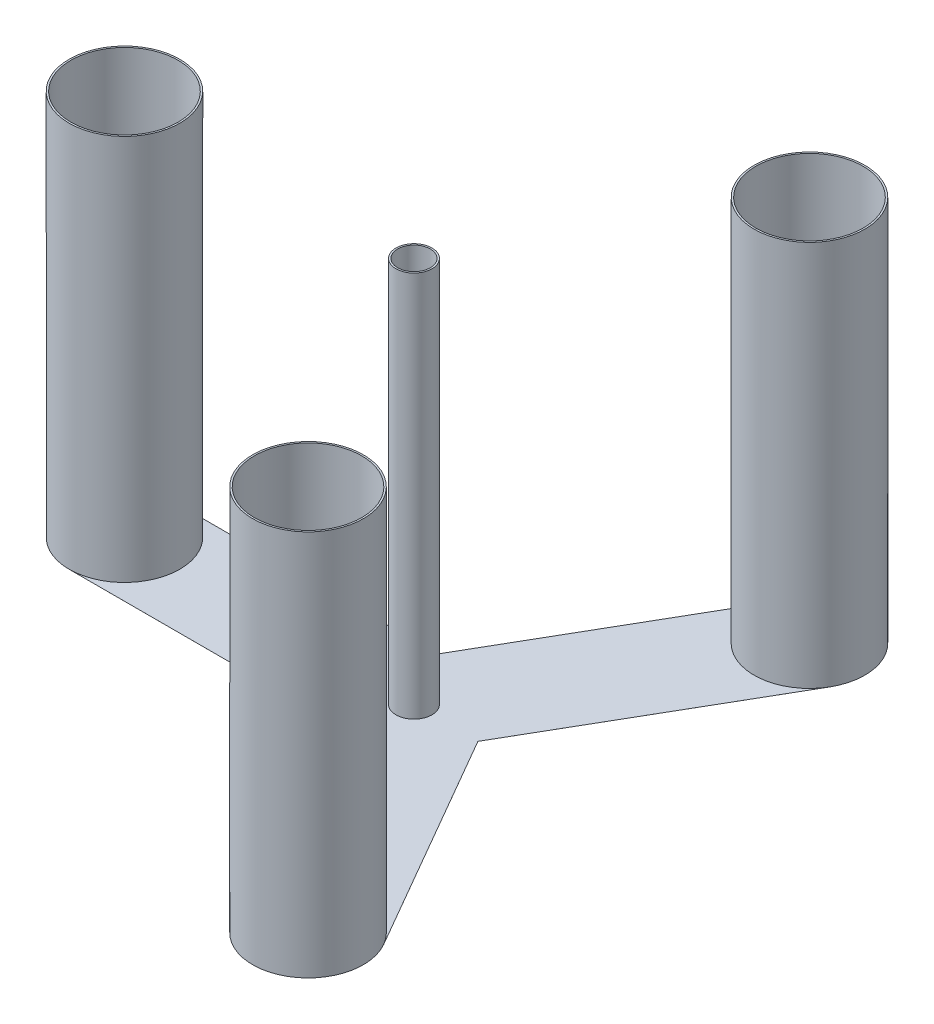
ISO-10303-21;
HEADER;
FILE_DESCRIPTION(('STEP AP214'),'2;1');
FILE_NAME('part.step','',(''),(''),'','','');
FILE_SCHEMA(('AUTOMOTIVE_DESIGN { 1 0 10303 214 1 1 1 1 }'));
ENDSEC;
DATA;
#1=APPLICATION_CONTEXT('core data for automotive mechanical design processes');
#2=APPLICATION_PROTOCOL_DEFINITION('international standard','automotive_design',2000,#1);
#3=PRODUCT_CONTEXT('',#1,'mechanical');
#4=PRODUCT('Part','Part','',(#3));
#5=PRODUCT_RELATED_PRODUCT_CATEGORY('part','',(#4));
#6=PRODUCT_DEFINITION_FORMATION('','',#4);
#7=PRODUCT_DEFINITION_CONTEXT('part definition',#1,'design');
#8=PRODUCT_DEFINITION('design','',#6,#7);
#9=PRODUCT_DEFINITION_SHAPE('','',#8);
#10=(LENGTH_UNIT() NAMED_UNIT(*) SI_UNIT(.MILLI.,.METRE.));
#11=(NAMED_UNIT(*) PLANE_ANGLE_UNIT() SI_UNIT($,.RADIAN.));
#12=(NAMED_UNIT(*) SI_UNIT($,.STERADIAN.) SOLID_ANGLE_UNIT());
#13=UNCERTAINTY_MEASURE_WITH_UNIT(LENGTH_MEASURE(1.E-05),#10,'distance_accuracy_value','');
#14=(GEOMETRIC_REPRESENTATION_CONTEXT(3) GLOBAL_UNCERTAINTY_ASSIGNED_CONTEXT((#13)) GLOBAL_UNIT_ASSIGNED_CONTEXT((#10,
#11,#12)) REPRESENTATION_CONTEXT('',''));
#15=CARTESIAN_POINT('',(0.,0.,0.));
#16=DIRECTION('',(0.,0.,1.));
#17=DIRECTION('',(1.,0.,0.));
#18=AXIS2_PLACEMENT_3D('',#15,#16,#17);
#19=CARTESIAN_POINT('',(-37.2390923627285,0.01,-64.5));
#20=DIRECTION('',(0.866025403784436,0.,0.500000000000004));
#21=DIRECTION('',(0.500000000000004,0.,-0.866025403784436));
#22=AXIS2_PLACEMENT_3D('',#19,#20,#21);
#23=PLANE('',#22);
#24=DIRECTION('',(-0.500000000000004,0.,0.866025403784436));
#25=VECTOR('',#24,1.);
#26=CARTESIAN_POINT('',(-37.2390923627285,0.,-64.5));
#27=LINE('',#26,#25);
#28=CARTESIAN_POINT('',(112.760907637273,0.,-324.307621135331));
#29=VERTEX_POINT('',#28);
#30=CARTESIAN_POINT('',(-37.2390923627285,0.,-64.5));
#31=VERTEX_POINT('',#30);
#32=EDGE_CURVE('E157',#29,#31,#27,.T.);
#33=ORIENTED_EDGE('',*,*,#32,.T.);
#34=DIRECTION('',(0.,-1.,0.));
#35=VECTOR('',#34,1.);
#36=CARTESIAN_POINT('',(-37.2390923627285,0.01,-64.5));
#37=LINE('',#36,#35);
#38=CARTESIAN_POINT('',(-37.2390923627285,0.01,-64.5));
#39=VERTEX_POINT('',#38);
#40=EDGE_CURVE('E205',#39,#31,#37,.T.);
#41=ORIENTED_EDGE('',*,*,#40,.F.);
#42=DIRECTION('',(-0.500000000000004,0.,0.866025403784436));
#43=VECTOR('',#42,1.);
#44=CARTESIAN_POINT('',(-37.2390923627285,0.01,-64.5));
#45=LINE('',#44,#43);
#46=CARTESIAN_POINT('',(112.760907637273,0.01,-324.307621135331));
#47=VERTEX_POINT('',#46);
#48=EDGE_CURVE('E183',#47,#39,#45,.T.);
#49=ORIENTED_EDGE('',*,*,#48,.F.);
#50=DIRECTION('',(0.,-1.,0.));
#51=VECTOR('',#50,1.);
#52=CARTESIAN_POINT('',(112.760907637273,0.01,-324.307621135331));
#53=LINE('',#52,#51);
#54=EDGE_CURVE('E151',#47,#29,#53,.T.);
#55=ORIENTED_EDGE('',*,*,#54,.T.);
#56=EDGE_LOOP('',(#33,#41,#49,#55));
#57=FACE_BOUND('',#56,.T.);
#58=ADVANCED_FACE('F41',(#57),#23,.F.);
#59=CARTESIAN_POINT('',(-37.2390923627285,0.01,-64.5));
#60=DIRECTION('',(0.,0.,1.));
#61=DIRECTION('',(1.,0.,0.));
#62=AXIS2_PLACEMENT_3D('',#59,#60,#61);
#63=PLANE('',#62);
#64=DIRECTION('',(-1.,0.,0.));
#65=VECTOR('',#64,1.);
#66=CARTESIAN_POINT('',(-37.2390923627285,0.,-64.5));
#67=LINE('',#66,#65);
#68=CARTESIAN_POINT('',(-337.239092362728,0.,-64.5));
#69=VERTEX_POINT('',#68);
#70=EDGE_CURVE('E161',#31,#69,#67,.T.);
#71=ORIENTED_EDGE('',*,*,#70,.T.);
#72=DIRECTION('',(0.,-1.,0.));
#73=VECTOR('',#72,1.);
#74=CARTESIAN_POINT('',(-337.239092362728,0.01,-64.5));
#75=LINE('',#74,#73);
#76=CARTESIAN_POINT('',(-337.239092362728,0.01,-64.5));
#77=VERTEX_POINT('',#76);
#78=EDGE_CURVE('E201',#77,#69,#75,.T.);
#79=ORIENTED_EDGE('',*,*,#78,.F.);
#80=DIRECTION('',(-1.,0.,0.));
#81=VECTOR('',#80,1.);
#82=CARTESIAN_POINT('',(-37.2390923627285,0.01,-64.5));
#83=LINE('',#82,#81);
#84=EDGE_CURVE('E106',#39,#77,#83,.T.);
#85=ORIENTED_EDGE('',*,*,#84,.F.);
#86=ORIENTED_EDGE('',*,*,#40,.T.);
#87=EDGE_LOOP('',(#71,#79,#85,#86));
#88=FACE_BOUND('',#87,.T.);
#89=ADVANCED_FACE('F238',(#88),#63,.F.);
#90=CARTESIAN_POINT('',(-337.239092362728,0.01,0.));
#91=DIRECTION('',(0.,-1.,0.));
#92=DIRECTION('',(0.,0.,-1.));
#93=AXIS2_PLACEMENT_3D('',#90,#91,#92);
#94=CYLINDRICAL_SURFACE('',#93,64.5);
#95=CARTESIAN_POINT('',(-337.239092362728,0.,0.));
#96=DIRECTION('',(0.,1.,0.));
#97=DIRECTION('',(0.,0.,-1.));
#98=AXIS2_PLACEMENT_3D('',#95,#96,#97);
#99=CIRCLE('',#98,64.5);
#100=CARTESIAN_POINT('',(-337.239092362728,0.,64.5));
#101=VERTEX_POINT('',#100);
#102=EDGE_CURVE('E165',#69,#101,#99,.T.);
#103=ORIENTED_EDGE('',*,*,#102,.T.);
#104=DIRECTION('',(0.,-1.,0.));
#105=VECTOR('',#104,1.);
#106=CARTESIAN_POINT('',(-337.239092362728,0.01,64.5));
#107=LINE('',#106,#105);
#108=CARTESIAN_POINT('',(-337.239092362728,0.01,64.5));
#109=VERTEX_POINT('',#108);
#110=EDGE_CURVE('E197',#109,#101,#107,.T.);
#111=ORIENTED_EDGE('',*,*,#110,.F.);
#112=CARTESIAN_POINT('',(-337.239092362728,0.01,0.));
#113=DIRECTION('',(0.,1.,0.));
#114=DIRECTION('',(0.,0.,1.));
#115=AXIS2_PLACEMENT_3D('',#112,#113,#114);
#116=CIRCLE('',#115,64.5);
#117=EDGE_CURVE('E254',#109,#77,#116,.T.);
#118=ORIENTED_EDGE('',*,*,#117,.T.);
#119=ORIENTED_EDGE('',*,*,#78,.T.);
#120=EDGE_LOOP('',(#103,#111,#118,#119));
#121=FACE_BOUND('',#120,.T.);
#122=CARTESIAN_POINT('',(-337.239092362728,450.01,0.));
#123=DIRECTION('',(0.,1.,0.));
#124=DIRECTION('',(0.,0.,1.));
#125=AXIS2_PLACEMENT_3D('',#122,#123,#124);
#126=CIRCLE('',#125,64.5);
#127=CARTESIAN_POINT('',(-337.239092362728,450.01,64.5));
#128=VERTEX_POINT('',#127);
#129=EDGE_CURVE('E257',#128,#128,#126,.T.);
#130=ORIENTED_EDGE('',*,*,#129,.F.);
#131=EDGE_LOOP('',(#130));
#132=FACE_BOUND('',#131,.T.);
#133=ADVANCED_FACE('F243',(#121,#132),#94,.T.);
#134=CARTESIAN_POINT('',(-337.239092362728,0.01,64.5));
#135=DIRECTION('',(0.,0.,-1.));
#136=DIRECTION('',(-1.,0.,0.));
#137=AXIS2_PLACEMENT_3D('',#134,#135,#136);
#138=PLANE('',#137);
#139=DIRECTION('',(1.,0.,0.));
#140=VECTOR('',#139,1.);
#141=CARTESIAN_POINT('',(-337.239092362728,0.,64.5));
#142=LINE('',#141,#140);
#143=CARTESIAN_POINT('',(-37.2390923627348,0.,64.5));
#144=VERTEX_POINT('',#143);
#145=EDGE_CURVE('E168',#101,#144,#142,.T.);
#146=ORIENTED_EDGE('',*,*,#145,.T.);
#147=DIRECTION('',(0.,-1.,0.));
#148=VECTOR('',#147,1.);
#149=CARTESIAN_POINT('',(-37.2390923627348,0.01,64.5));
#150=LINE('',#149,#148);
#151=CARTESIAN_POINT('',(-37.2390923627348,0.01,64.5));
#152=VERTEX_POINT('',#151);
#153=EDGE_CURVE('E193',#152,#144,#150,.T.);
#154=ORIENTED_EDGE('',*,*,#153,.F.);
#155=DIRECTION('',(1.,0.,0.));
#156=VECTOR('',#155,1.);
#157=CARTESIAN_POINT('',(-337.239092362728,0.01,64.5));
#158=LINE('',#157,#156);
#159=EDGE_CURVE('E153',#109,#152,#158,.T.);
#160=ORIENTED_EDGE('',*,*,#159,.F.);
#161=ORIENTED_EDGE('',*,*,#110,.T.);
#162=EDGE_LOOP('',(#146,#154,#160,#161));
#163=FACE_BOUND('',#162,.T.);
#164=ADVANCED_FACE('F298',(#163),#138,.F.);
#165=CARTESIAN_POINT('',(112.760907637267,0.01,324.307621135331));
#166=DIRECTION('',(0.866025403784436,0.,-0.500000000000004));
#167=DIRECTION('',(-0.500000000000004,0.,-0.866025403784436));
#168=AXIS2_PLACEMENT_3D('',#165,#166,#167);
#169=PLANE('',#168);
#170=DIRECTION('',(0.500000000000004,0.,0.866025403784436));
#171=VECTOR('',#170,1.);
#172=CARTESIAN_POINT('',(112.760907637267,0.,324.307621135331));
#173=LINE('',#172,#171);
#174=CARTESIAN_POINT('',(112.760907637267,0.,324.307621135331));
#175=VERTEX_POINT('',#174);
#176=EDGE_CURVE('E171',#144,#175,#173,.T.);
#177=ORIENTED_EDGE('',*,*,#176,.T.);
#178=DIRECTION('',(0.,-1.,0.));
#179=VECTOR('',#178,1.);
#180=CARTESIAN_POINT('',(112.760907637267,0.01,324.307621135331));
#181=LINE('',#180,#179);
#182=CARTESIAN_POINT('',(112.760907637267,0.01,324.307621135331));
#183=VERTEX_POINT('',#182);
#184=EDGE_CURVE('E143',#183,#175,#181,.T.);
#185=ORIENTED_EDGE('',*,*,#184,.F.);
#186=DIRECTION('',(0.500000000000004,0.,0.866025403784436));
#187=VECTOR('',#186,1.);
#188=CARTESIAN_POINT('',(112.760907637267,0.01,324.307621135331));
#189=LINE('',#188,#187);
#190=EDGE_CURVE('E127',#152,#183,#189,.T.);
#191=ORIENTED_EDGE('',*,*,#190,.F.);
#192=ORIENTED_EDGE('',*,*,#153,.T.);
#193=EDGE_LOOP('',(#177,#185,#191,#192));
#194=FACE_BOUND('',#193,.T.);
#195=ADVANCED_FACE('F302',(#194),#169,.F.);
#196=CARTESIAN_POINT('',(168.619546181364,0.01,292.057621135332));
#197=DIRECTION('',(0.,-1.,0.));
#198=DIRECTION('',(0.,0.,-1.));
#199=AXIS2_PLACEMENT_3D('',#196,#197,#198);
#200=CYLINDRICAL_SURFACE('',#199,64.5);
#201=CARTESIAN_POINT('',(168.619546181364,0.,292.057621135332));
#202=DIRECTION('',(0.,1.,0.));
#203=DIRECTION('',(0.,0.,-1.));
#204=AXIS2_PLACEMENT_3D('',#201,#202,#203);
#205=CIRCLE('',#204,64.5);
#206=CARTESIAN_POINT('',(224.47818472546,0.,259.807621135333));
#207=VERTEX_POINT('',#206);
#208=EDGE_CURVE('E139',#175,#207,#205,.T.);
#209=ORIENTED_EDGE('',*,*,#208,.T.);
#210=DIRECTION('',(0.,-1.,0.));
#211=VECTOR('',#210,1.);
#212=CARTESIAN_POINT('',(224.47818472546,0.01,259.807621135333));
#213=LINE('',#212,#211);
#214=CARTESIAN_POINT('',(224.47818472546,0.01,259.807621135333));
#215=VERTEX_POINT('',#214);
#216=EDGE_CURVE('E135',#215,#207,#213,.T.);
#217=ORIENTED_EDGE('',*,*,#216,.F.);
#218=CARTESIAN_POINT('',(168.619546181364,0.01,292.057621135332));
#219=DIRECTION('',(0.,1.,0.));
#220=DIRECTION('',(0.,0.,1.));
#221=AXIS2_PLACEMENT_3D('',#218,#219,#220);
#222=CIRCLE('',#221,64.5);
#223=EDGE_CURVE('E118',#215,#183,#222,.T.);
#224=ORIENTED_EDGE('',*,*,#223,.T.);
#225=ORIENTED_EDGE('',*,*,#184,.T.);
#226=EDGE_LOOP('',(#209,#217,#224,#225));
#227=FACE_BOUND('',#226,.T.);
#228=CARTESIAN_POINT('',(168.619546181364,450.01,292.057621135332));
#229=DIRECTION('',(0.,1.,0.));
#230=DIRECTION('',(0.,0.,1.));
#231=AXIS2_PLACEMENT_3D('',#228,#229,#230);
#232=CIRCLE('',#231,64.5);
#233=CARTESIAN_POINT('',(168.619546181364,450.01,356.557621135332));
#234=VERTEX_POINT('',#233);
#235=EDGE_CURVE('E131',#234,#234,#232,.T.);
#236=ORIENTED_EDGE('',*,*,#235,.F.);
#237=EDGE_LOOP('',(#236));
#238=FACE_BOUND('',#237,.T.);
#239=ADVANCED_FACE('F136',(#227,#238),#200,.T.);
#240=CARTESIAN_POINT('',(74.4781847254622,0.01,0.));
#241=DIRECTION('',(-0.866025403784442,0.,0.499999999999994));
#242=DIRECTION('',(0.499999999999994,0.,0.866025403784442));
#243=AXIS2_PLACEMENT_3D('',#240,#241,#242);
#244=PLANE('',#243);
#245=DIRECTION('',(-0.499999999999994,0.,-0.866025403784442));
#246=VECTOR('',#245,1.);
#247=CARTESIAN_POINT('',(74.4781847254622,0.,0.));
#248=LINE('',#247,#246);
#249=CARTESIAN_POINT('',(74.4781847254622,0.,0.));
#250=VERTEX_POINT('',#249);
#251=EDGE_CURVE('E176',#207,#250,#248,.T.);
#252=ORIENTED_EDGE('',*,*,#251,.T.);
#253=DIRECTION('',(0.,-1.,0.));
#254=VECTOR('',#253,1.);
#255=CARTESIAN_POINT('',(74.4781847254622,0.01,0.));
#256=LINE('',#255,#254);
#257=CARTESIAN_POINT('',(74.4781847254622,0.01,0.));
#258=VERTEX_POINT('',#257);
#259=EDGE_CURVE('E144',#258,#250,#256,.T.);
#260=ORIENTED_EDGE('',*,*,#259,.F.);
#261=DIRECTION('',(-0.499999999999994,0.,-0.866025403784442));
#262=VECTOR('',#261,1.);
#263=CARTESIAN_POINT('',(74.4781847254622,0.01,0.));
#264=LINE('',#263,#262);
#265=EDGE_CURVE('E123',#215,#258,#264,.T.);
#266=ORIENTED_EDGE('',*,*,#265,.F.);
#267=ORIENTED_EDGE('',*,*,#216,.T.);
#268=EDGE_LOOP('',(#252,#260,#266,#267));
#269=FACE_BOUND('',#268,.T.);
#270=ADVANCED_FACE('F146',(#269),#244,.F.);
#271=CARTESIAN_POINT('',(224.478184725465,0.01,-259.80762113533));
#272=DIRECTION('',(-0.866025403784433,0.,-0.500000000000009));
#273=DIRECTION('',(-0.500000000000009,0.,0.866025403784434));
#274=AXIS2_PLACEMENT_3D('',#271,#272,#273);
#275=PLANE('',#274);
#276=DIRECTION('',(0.500000000000009,0.,-0.866025403784434));
#277=VECTOR('',#276,1.);
#278=CARTESIAN_POINT('',(224.478184725465,0.,-259.80762113533));
#279=LINE('',#278,#277);
#280=CARTESIAN_POINT('',(224.478184725465,0.,-259.80762113533));
#281=VERTEX_POINT('',#280);
#282=EDGE_CURVE('E90',#250,#281,#279,.T.);
#283=ORIENTED_EDGE('',*,*,#282,.T.);
#284=DIRECTION('',(0.,-1.,0.));
#285=VECTOR('',#284,1.);
#286=CARTESIAN_POINT('',(224.478184725465,0.01,-259.80762113533));
#287=LINE('',#286,#285);
#288=CARTESIAN_POINT('',(224.478184725465,0.01,-259.80762113533));
#289=VERTEX_POINT('',#288);
#290=EDGE_CURVE('E186',#289,#281,#287,.T.);
#291=ORIENTED_EDGE('',*,*,#290,.F.);
#292=DIRECTION('',(0.500000000000009,0.,-0.866025403784434));
#293=VECTOR('',#292,1.);
#294=CARTESIAN_POINT('',(224.478184725465,0.01,-259.80762113533));
#295=LINE('',#294,#293);
#296=EDGE_CURVE('E58',#258,#289,#295,.T.);
#297=ORIENTED_EDGE('',*,*,#296,.F.);
#298=ORIENTED_EDGE('',*,*,#259,.T.);
#299=EDGE_LOOP('',(#283,#291,#297,#298));
#300=FACE_BOUND('',#299,.T.);
#301=ADVANCED_FACE('F225',(#300),#275,.F.);
#302=CARTESIAN_POINT('',(168.619546181369,0.01,-292.057621135331));
#303=DIRECTION('',(0.,-1.,0.));
#304=DIRECTION('',(0.,0.,-1.));
#305=AXIS2_PLACEMENT_3D('',#302,#303,#304);
#306=CYLINDRICAL_SURFACE('',#305,64.5);
#307=CARTESIAN_POINT('',(168.619546181369,0.,-292.057621135331));
#308=DIRECTION('',(0.,1.,0.));
#309=DIRECTION('',(0.,0.,-1.));
#310=AXIS2_PLACEMENT_3D('',#307,#308,#309);
#311=CIRCLE('',#310,64.5);
#312=EDGE_CURVE('E97',#281,#29,#311,.T.);
#313=ORIENTED_EDGE('',*,*,#312,.T.);
#314=ORIENTED_EDGE('',*,*,#54,.F.);
#315=CARTESIAN_POINT('',(168.619546181369,0.01000000000001,-292.057621135331));
#316=DIRECTION('',(0.,-1.,0.));
#317=DIRECTION('',(0.,0.,-1.));
#318=AXIS2_PLACEMENT_3D('',#315,#316,#317);
#319=CIRCLE('',#318,64.5);
#320=EDGE_CURVE('E11',#47,#289,#319,.F.);
#321=ORIENTED_EDGE('',*,*,#320,.T.);
#322=ORIENTED_EDGE('',*,*,#290,.T.);
#323=EDGE_LOOP('',(#313,#314,#321,#322));
#324=FACE_BOUND('',#323,.T.);
#325=CARTESIAN_POINT('',(168.619546181369,450.01,-292.057621135331));
#326=DIRECTION('',(0.,1.,0.));
#327=DIRECTION('',(0.,0.,1.));
#328=AXIS2_PLACEMENT_3D('',#325,#326,#327);
#329=CIRCLE('',#328,64.5);
#330=CARTESIAN_POINT('',(168.619546181369,450.01,-227.557621135331));
#331=VERTEX_POINT('',#330);
#332=EDGE_CURVE('E274',#331,#331,#329,.T.);
#333=ORIENTED_EDGE('',*,*,#332,.F.);
#334=EDGE_LOOP('',(#333));
#335=FACE_BOUND('',#334,.T.);
#336=ADVANCED_FACE('F214',(#324,#335),#306,.T.);
#337=CARTESIAN_POINT('',(168.619546181369,0.01,-292.057621135331));
#338=DIRECTION('',(0.,-1.,0.));
#339=DIRECTION('',(0.,0.,-1.));
#340=AXIS2_PLACEMENT_3D('',#337,#338,#339);
#341=PLANE('',#340);
#342=ORIENTED_EDGE('',*,*,#223,.F.);
#343=ORIENTED_EDGE('',*,*,#265,.T.);
#344=ORIENTED_EDGE('',*,*,#296,.T.);
#345=ORIENTED_EDGE('',*,*,#320,.F.);
#346=ORIENTED_EDGE('',*,*,#48,.T.);
#347=ORIENTED_EDGE('',*,*,#84,.T.);
#348=ORIENTED_EDGE('',*,*,#117,.F.);
#349=ORIENTED_EDGE('',*,*,#159,.T.);
#350=ORIENTED_EDGE('',*,*,#190,.T.);
#351=EDGE_LOOP('',(#342,#343,#344,#345,#346,#347,#348,#349,#350));
#352=FACE_BOUND('',#351,.T.);
#353=CARTESIAN_POINT('',(0.,0.01000000000001,0.));
#354=DIRECTION('',(0.,-1.,0.));
#355=DIRECTION('',(0.,0.,-1.));
#356=AXIS2_PLACEMENT_3D('',#353,#354,#355);
#357=CIRCLE('',#356,21.);
#358=CARTESIAN_POINT('',(0.,0.01000000000001,-21.));
#359=VERTEX_POINT('',#358);
#360=EDGE_CURVE('E50',#359,#359,#357,.F.);
#361=ORIENTED_EDGE('',*,*,#360,.F.);
#362=EDGE_LOOP('',(#361));
#363=FACE_BOUND('',#362,.T.);
#364=ADVANCED_FACE('F120',(#352,#363),#341,.F.);
#365=CARTESIAN_POINT('',(168.619546181369,0.,-292.057621135331));
#366=DIRECTION('',(0.,-1.,0.));
#367=DIRECTION('',(0.,0.,-1.));
#368=AXIS2_PLACEMENT_3D('',#365,#366,#367);
#369=PLANE('',#368);
#370=ORIENTED_EDGE('',*,*,#32,.F.);
#371=ORIENTED_EDGE('',*,*,#312,.F.);
#372=ORIENTED_EDGE('',*,*,#282,.F.);
#373=ORIENTED_EDGE('',*,*,#251,.F.);
#374=ORIENTED_EDGE('',*,*,#208,.F.);
#375=ORIENTED_EDGE('',*,*,#176,.F.);
#376=ORIENTED_EDGE('',*,*,#145,.F.);
#377=ORIENTED_EDGE('',*,*,#102,.F.);
#378=ORIENTED_EDGE('',*,*,#70,.F.);
#379=EDGE_LOOP('',(#370,#371,#372,#373,#374,#375,#376,#377,#378));
#380=FACE_BOUND('',#379,.T.);
#381=ADVANCED_FACE('F213',(#380),#369,.T.);
#382=CARTESIAN_POINT('',(0.,450.01,0.));
#383=DIRECTION('',(0.,1.,0.));
#384=DIRECTION('',(0.,0.,1.));
#385=AXIS2_PLACEMENT_3D('',#382,#383,#384);
#386=PLANE('',#385);
#387=CARTESIAN_POINT('',(0.,450.01,0.));
#388=DIRECTION('',(0.,1.,0.));
#389=DIRECTION('',(0.,0.,1.));
#390=AXIS2_PLACEMENT_3D('',#387,#388,#389);
#391=CIRCLE('',#390,21.);
#392=CARTESIAN_POINT('',(0.,450.01,21.));
#393=VERTEX_POINT('',#392);
#394=EDGE_CURVE('E162',#393,#393,#391,.T.);
#395=ORIENTED_EDGE('',*,*,#394,.T.);
#396=EDGE_LOOP('',(#395));
#397=FACE_BOUND('',#396,.T.);
#398=CARTESIAN_POINT('',(0.,450.01,0.));
#399=DIRECTION('',(0.,1.,0.));
#400=DIRECTION('',(0.,0.,1.));
#401=AXIS2_PLACEMENT_3D('',#398,#399,#400);
#402=CIRCLE('',#401,19.);
#403=CARTESIAN_POINT('',(0.,450.01,19.));
#404=VERTEX_POINT('',#403);
#405=EDGE_CURVE('E282',#404,#404,#402,.T.);
#406=ORIENTED_EDGE('',*,*,#405,.F.);
#407=EDGE_LOOP('',(#406));
#408=FACE_BOUND('',#407,.T.);
#409=ADVANCED_FACE('F222',(#397,#408),#386,.T.);
#410=CARTESIAN_POINT('',(0.,450.01,0.));
#411=DIRECTION('',(0.,-1.,0.));
#412=DIRECTION('',(0.,0.,-1.));
#413=AXIS2_PLACEMENT_3D('',#410,#411,#412);
#414=CYLINDRICAL_SURFACE('',#413,21.);
#415=ORIENTED_EDGE('',*,*,#394,.F.);
#416=EDGE_LOOP('',(#415));
#417=FACE_BOUND('',#416,.T.);
#418=ORIENTED_EDGE('',*,*,#360,.T.);
#419=EDGE_LOOP('',(#418));
#420=FACE_BOUND('',#419,.T.);
#421=ADVANCED_FACE('F211',(#417,#420),#414,.T.);
#422=CARTESIAN_POINT('',(0.,450.01,0.));
#423=DIRECTION('',(0.,-1.,0.));
#424=DIRECTION('',(0.,0.,-1.));
#425=AXIS2_PLACEMENT_3D('',#422,#423,#424);
#426=CYLINDRICAL_SURFACE('',#425,19.);
#427=ORIENTED_EDGE('',*,*,#405,.T.);
#428=EDGE_LOOP('',(#427));
#429=FACE_BOUND('',#428,.T.);
#430=CARTESIAN_POINT('',(0.,0.01,0.));
#431=DIRECTION('',(0.,1.,0.));
#432=DIRECTION('',(0.,0.,1.));
#433=AXIS2_PLACEMENT_3D('',#430,#431,#432);
#434=CIRCLE('',#433,19.);
#435=CARTESIAN_POINT('',(0.,0.01,19.));
#436=VERTEX_POINT('',#435);
#437=EDGE_CURVE('E281',#436,#436,#434,.T.);
#438=ORIENTED_EDGE('',*,*,#437,.F.);
#439=EDGE_LOOP('',(#438));
#440=FACE_BOUND('',#439,.T.);
#441=ADVANCED_FACE('F234',(#429,#440),#426,.F.);
#442=ORIENTED_EDGE('',*,*,#437,.T.);
#443=EDGE_LOOP('',(#442));
#444=FACE_BOUND('',#443,.T.);
#445=ADVANCED_FACE('F217',(#444),#341,.F.);
#446=CARTESIAN_POINT('',(168.619546181369,450.01,-292.057621135331));
#447=DIRECTION('',(0.,1.,0.));
#448=DIRECTION('',(0.,0.,1.));
#449=AXIS2_PLACEMENT_3D('',#446,#447,#448);
#450=PLANE('',#449);
#451=ORIENTED_EDGE('',*,*,#332,.T.);
#452=EDGE_LOOP('',(#451));
#453=FACE_BOUND('',#452,.T.);
#454=CARTESIAN_POINT('',(168.619546181369,450.01,-292.057621135331));
#455=DIRECTION('',(0.,1.,0.));
#456=DIRECTION('',(0.,0.,1.));
#457=AXIS2_PLACEMENT_3D('',#454,#455,#456);
#458=CIRCLE('',#457,62.5);
#459=CARTESIAN_POINT('',(168.619546181369,450.01,-229.557621135331));
#460=VERTEX_POINT('',#459);
#461=EDGE_CURVE('E270',#460,#460,#458,.T.);
#462=ORIENTED_EDGE('',*,*,#461,.F.);
#463=EDGE_LOOP('',(#462));
#464=FACE_BOUND('',#463,.T.);
#465=ADVANCED_FACE('F233',(#453,#464),#450,.T.);
#466=CARTESIAN_POINT('',(168.619546181369,450.01,-292.057621135331));
#467=DIRECTION('',(0.,-1.,0.));
#468=DIRECTION('',(0.,0.,-1.));
#469=AXIS2_PLACEMENT_3D('',#466,#467,#468);
#470=CYLINDRICAL_SURFACE('',#469,62.5);
#471=ORIENTED_EDGE('',*,*,#461,.T.);
#472=EDGE_LOOP('',(#471));
#473=FACE_BOUND('',#472,.T.);
#474=CARTESIAN_POINT('',(168.619546181369,0.01,-292.057621135331));
#475=DIRECTION('',(0.,1.,0.));
#476=DIRECTION('',(0.,0.,1.));
#477=AXIS2_PLACEMENT_3D('',#474,#475,#476);
#478=CIRCLE('',#477,62.5);
#479=CARTESIAN_POINT('',(168.619546181369,0.01,-229.557621135331));
#480=VERTEX_POINT('',#479);
#481=EDGE_CURVE('E263',#480,#480,#478,.T.);
#482=ORIENTED_EDGE('',*,*,#481,.F.);
#483=EDGE_LOOP('',(#482));
#484=FACE_BOUND('',#483,.T.);
#485=ADVANCED_FACE('F309',(#473,#484),#470,.F.);
#486=ORIENTED_EDGE('',*,*,#481,.T.);
#487=EDGE_LOOP('',(#486));
#488=FACE_BOUND('',#487,.T.);
#489=ADVANCED_FACE('F236',(#488),#341,.F.);
#490=CARTESIAN_POINT('',(-337.239092362728,450.01,0.));
#491=DIRECTION('',(0.,1.,0.));
#492=DIRECTION('',(0.,0.,1.));
#493=AXIS2_PLACEMENT_3D('',#490,#491,#492);
#494=PLANE('',#493);
#495=ORIENTED_EDGE('',*,*,#129,.T.);
#496=EDGE_LOOP('',(#495));
#497=FACE_BOUND('',#496,.T.);
#498=CARTESIAN_POINT('',(-337.239092362728,450.01,0.));
#499=DIRECTION('',(0.,1.,0.));
#500=DIRECTION('',(0.,0.,1.));
#501=AXIS2_PLACEMENT_3D('',#498,#499,#500);
#502=CIRCLE('',#501,62.5);
#503=CARTESIAN_POINT('',(-337.239092362728,450.01,62.5));
#504=VERTEX_POINT('',#503);
#505=EDGE_CURVE('E258',#504,#504,#502,.T.);
#506=ORIENTED_EDGE('',*,*,#505,.F.);
#507=EDGE_LOOP('',(#506));
#508=FACE_BOUND('',#507,.T.);
#509=ADVANCED_FACE('F319',(#497,#508),#494,.T.);
#510=CARTESIAN_POINT('',(-337.239092362728,450.01,0.));
#511=DIRECTION('',(0.,-1.,0.));
#512=DIRECTION('',(0.,0.,-1.));
#513=AXIS2_PLACEMENT_3D('',#510,#511,#512);
#514=CYLINDRICAL_SURFACE('',#513,62.5);
#515=ORIENTED_EDGE('',*,*,#505,.T.);
#516=EDGE_LOOP('',(#515));
#517=FACE_BOUND('',#516,.T.);
#518=CARTESIAN_POINT('',(-337.239092362728,0.01,0.));
#519=DIRECTION('',(0.,1.,0.));
#520=DIRECTION('',(0.,0.,1.));
#521=AXIS2_PLACEMENT_3D('',#518,#519,#520);
#522=CIRCLE('',#521,62.5);
#523=CARTESIAN_POINT('',(-337.239092362728,0.01,62.5));
#524=VERTEX_POINT('',#523);
#525=EDGE_CURVE('E266',#524,#524,#522,.T.);
#526=ORIENTED_EDGE('',*,*,#525,.F.);
#527=EDGE_LOOP('',(#526));
#528=FACE_BOUND('',#527,.T.);
#529=ADVANCED_FACE('F323',(#517,#528),#514,.F.);
#530=ORIENTED_EDGE('',*,*,#525,.T.);
#531=EDGE_LOOP('',(#530));
#532=FACE_BOUND('',#531,.T.);
#533=ADVANCED_FACE('F231',(#532),#341,.F.);
#534=CARTESIAN_POINT('',(168.619546181364,450.01,292.057621135332));
#535=DIRECTION('',(0.,1.,0.));
#536=DIRECTION('',(0.,0.,1.));
#537=AXIS2_PLACEMENT_3D('',#534,#535,#536);
#538=PLANE('',#537);
#539=ORIENTED_EDGE('',*,*,#235,.T.);
#540=EDGE_LOOP('',(#539));
#541=FACE_BOUND('',#540,.T.);
#542=CARTESIAN_POINT('',(168.619546181364,450.01,292.057621135332));
#543=DIRECTION('',(0.,1.,0.));
#544=DIRECTION('',(0.,0.,1.));
#545=AXIS2_PLACEMENT_3D('',#542,#543,#544);
#546=CIRCLE('',#545,62.5);
#547=CARTESIAN_POINT('',(168.619546181364,450.01,354.557621135332));
#548=VERTEX_POINT('',#547);
#549=EDGE_CURVE('E132',#548,#548,#546,.T.);
#550=ORIENTED_EDGE('',*,*,#549,.F.);
#551=EDGE_LOOP('',(#550));
#552=FACE_BOUND('',#551,.T.);
#553=ADVANCED_FACE('F327',(#541,#552),#538,.T.);
#554=CARTESIAN_POINT('',(168.619546181364,450.01,292.057621135332));
#555=DIRECTION('',(0.,-1.,0.));
#556=DIRECTION('',(0.,0.,-1.));
#557=AXIS2_PLACEMENT_3D('',#554,#555,#556);
#558=CYLINDRICAL_SURFACE('',#557,62.5);
#559=ORIENTED_EDGE('',*,*,#549,.T.);
#560=EDGE_LOOP('',(#559));
#561=FACE_BOUND('',#560,.T.);
#562=CARTESIAN_POINT('',(168.619546181364,0.01,292.057621135332));
#563=DIRECTION('',(0.,1.,0.));
#564=DIRECTION('',(0.,0.,1.));
#565=AXIS2_PLACEMENT_3D('',#562,#563,#564);
#566=CIRCLE('',#565,62.5);
#567=CARTESIAN_POINT('',(168.619546181364,0.01,354.557621135332));
#568=VERTEX_POINT('',#567);
#569=EDGE_CURVE('E345',#568,#568,#566,.T.);
#570=ORIENTED_EDGE('',*,*,#569,.F.);
#571=EDGE_LOOP('',(#570));
#572=FACE_BOUND('',#571,.T.);
#573=ADVANCED_FACE('F229',(#561,#572),#558,.F.);
#574=ORIENTED_EDGE('',*,*,#569,.T.);
#575=EDGE_LOOP('',(#574));
#576=FACE_BOUND('',#575,.T.);
#577=ADVANCED_FACE('F216',(#576),#341,.F.);
#578=CLOSED_SHELL('',(#58,#89,#133,#164,#195,#239,#270,#301,#336,#364,#381,#409,#421,#441,#445,
#465,#485,#489,#509,#529,#533,#553,#573,#577));
#579=MANIFOLD_SOLID_BREP('B2',#578);
#580=ADVANCED_BREP_SHAPE_REPRESENTATION('',(#18,#579),#14);
#581=SHAPE_DEFINITION_REPRESENTATION(#9,#580);
ENDSEC;
END-ISO-10303-21;
